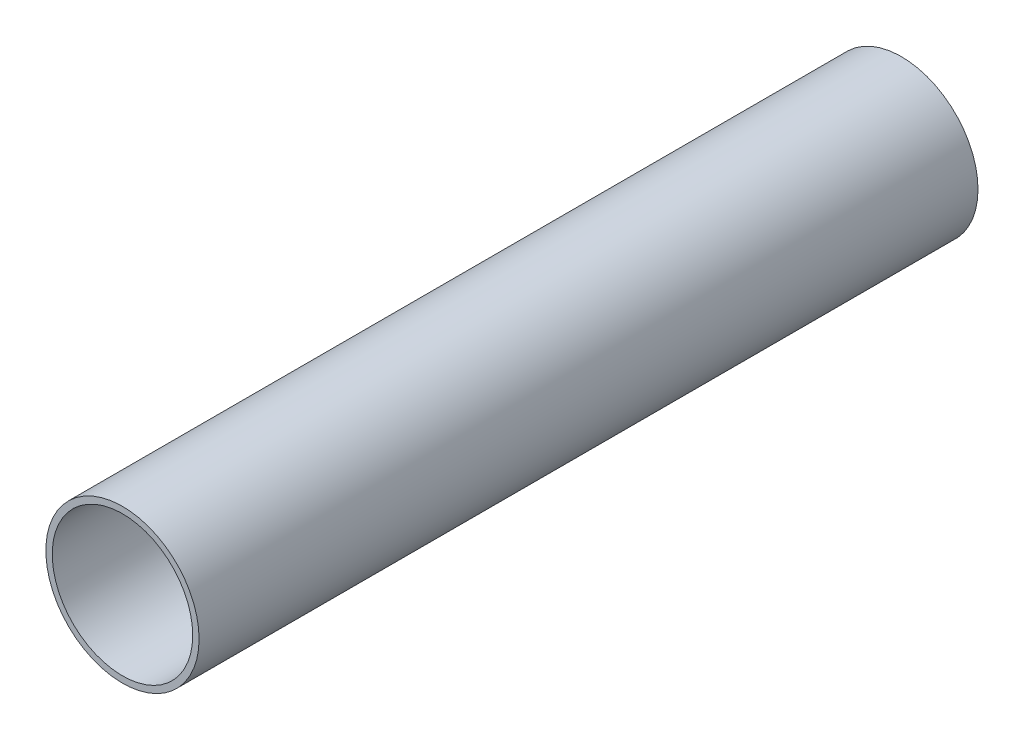
ISO-10303-21;
HEADER;
FILE_DESCRIPTION(('STEP AP214'),'2;1');
FILE_NAME('part.step','',(''),(''),'','','');
FILE_SCHEMA(('AUTOMOTIVE_DESIGN { 1 0 10303 214 1 1 1 1 }'));
ENDSEC;
DATA;
#1=APPLICATION_CONTEXT('core data for automotive mechanical design processes');
#2=APPLICATION_PROTOCOL_DEFINITION('international standard','automotive_design',2000,#1);
#3=PRODUCT_CONTEXT('',#1,'mechanical');
#4=PRODUCT('Part','Part','',(#3));
#5=PRODUCT_RELATED_PRODUCT_CATEGORY('part','',(#4));
#6=PRODUCT_DEFINITION_FORMATION('','',#4);
#7=PRODUCT_DEFINITION_CONTEXT('part definition',#1,'design');
#8=PRODUCT_DEFINITION('design','',#6,#7);
#9=PRODUCT_DEFINITION_SHAPE('','',#8);
#10=(LENGTH_UNIT() NAMED_UNIT(*) SI_UNIT(.MILLI.,.METRE.));
#11=(NAMED_UNIT(*) PLANE_ANGLE_UNIT() SI_UNIT($,.RADIAN.));
#12=(NAMED_UNIT(*) SI_UNIT($,.STERADIAN.) SOLID_ANGLE_UNIT());
#13=UNCERTAINTY_MEASURE_WITH_UNIT(LENGTH_MEASURE(1.E-05),#10,'distance_accuracy_value','');
#14=(GEOMETRIC_REPRESENTATION_CONTEXT(3) GLOBAL_UNCERTAINTY_ASSIGNED_CONTEXT((#13)) GLOBAL_UNIT_ASSIGNED_CONTEXT((#10,
#11,#12)) REPRESENTATION_CONTEXT('',''));
#15=CARTESIAN_POINT('',(0.,0.,0.));
#16=DIRECTION('',(0.,0.,1.));
#17=DIRECTION('',(1.,0.,0.));
#18=AXIS2_PLACEMENT_3D('',#15,#16,#17);
#19=CARTESIAN_POINT('',(0.,0.,762.));
#20=DIRECTION('',(0.,0.,-1.));
#21=DIRECTION('',(-1.,0.,0.));
#22=AXIS2_PLACEMENT_3D('',#19,#20,#21);
#23=CYLINDRICAL_SURFACE('',#22,69.85);
#24=CARTESIAN_POINT('',(0.,0.,762.));
#25=DIRECTION('',(0.,0.,1.));
#26=DIRECTION('',(1.,0.,0.));
#27=AXIS2_PLACEMENT_3D('',#24,#25,#26);
#28=CIRCLE('',#27,69.85);
#29=CARTESIAN_POINT('',(69.85,0.,762.));
#30=VERTEX_POINT('',#29);
#31=EDGE_CURVE('E43',#30,#30,#28,.T.);
#32=ORIENTED_EDGE('',*,*,#31,.T.);
#33=EDGE_LOOP('',(#32));
#34=FACE_BOUND('',#33,.T.);
#35=CARTESIAN_POINT('',(0.,0.,0.));
#36=DIRECTION('',(0.,0.,1.));
#37=DIRECTION('',(1.,0.,0.));
#38=AXIS2_PLACEMENT_3D('',#35,#36,#37);
#39=CIRCLE('',#38,69.85);
#40=CARTESIAN_POINT('',(69.85,0.,0.));
#41=VERTEX_POINT('',#40);
#42=EDGE_CURVE('E39',#41,#41,#39,.T.);
#43=ORIENTED_EDGE('',*,*,#42,.F.);
#44=EDGE_LOOP('',(#43));
#45=FACE_BOUND('',#44,.T.);
#46=ADVANCED_FACE('F36',(#34,#45),#23,.F.);
#47=CARTESIAN_POINT('',(0.,0.,762.));
#48=DIRECTION('',(0.,0.,-1.));
#49=DIRECTION('',(-1.,0.,0.));
#50=AXIS2_PLACEMENT_3D('',#47,#48,#49);
#51=CYLINDRICAL_SURFACE('',#50,76.2);
#52=CARTESIAN_POINT('',(0.,0.,762.));
#53=DIRECTION('',(0.,0.,1.));
#54=DIRECTION('',(1.,0.,0.));
#55=AXIS2_PLACEMENT_3D('',#52,#53,#54);
#56=CIRCLE('',#55,76.2);
#57=CARTESIAN_POINT('',(76.2,0.,762.));
#58=VERTEX_POINT('',#57);
#59=EDGE_CURVE('E10',#58,#58,#56,.T.);
#60=ORIENTED_EDGE('',*,*,#59,.F.);
#61=EDGE_LOOP('',(#60));
#62=FACE_BOUND('',#61,.T.);
#63=CARTESIAN_POINT('',(0.,0.,-12.7));
#64=DIRECTION('',(0.,0.,1.));
#65=DIRECTION('',(1.,0.,0.));
#66=AXIS2_PLACEMENT_3D('',#63,#64,#65);
#67=CIRCLE('',#66,76.2);
#68=CARTESIAN_POINT('',(76.2,0.,-12.7));
#69=VERTEX_POINT('',#68);
#70=EDGE_CURVE('E53',#69,#69,#67,.T.);
#71=ORIENTED_EDGE('',*,*,#70,.T.);
#72=EDGE_LOOP('',(#71));
#73=FACE_BOUND('',#72,.T.);
#74=ADVANCED_FACE('F77',(#62,#73),#51,.T.);
#75=CARTESIAN_POINT('',(0.,0.,762.));
#76=DIRECTION('',(0.,0.,1.));
#77=DIRECTION('',(1.,0.,0.));
#78=AXIS2_PLACEMENT_3D('',#75,#76,#77);
#79=PLANE('',#78);
#80=ORIENTED_EDGE('',*,*,#31,.F.);
#81=EDGE_LOOP('',(#80));
#82=FACE_BOUND('',#81,.T.);
#83=ORIENTED_EDGE('',*,*,#59,.T.);
#84=EDGE_LOOP('',(#83));
#85=FACE_BOUND('',#84,.T.);
#86=ADVANCED_FACE('F71',(#82,#85),#79,.T.);
#87=CARTESIAN_POINT('',(0.,0.,0.));
#88=DIRECTION('',(0.,0.,1.));
#89=DIRECTION('',(1.,0.,0.));
#90=AXIS2_PLACEMENT_3D('',#87,#88,#89);
#91=PLANE('',#90);
#92=CARTESIAN_POINT('',(0.,0.,0.));
#93=DIRECTION('',(0.,0.,1.));
#94=DIRECTION('',(1.,0.,0.));
#95=AXIS2_PLACEMENT_3D('',#92,#93,#94);
#96=CIRCLE('',#95,63.5);
#97=CARTESIAN_POINT('',(63.5,0.,0.));
#98=VERTEX_POINT('',#97);
#99=EDGE_CURVE('E49',#98,#98,#96,.T.);
#100=ORIENTED_EDGE('',*,*,#99,.F.);
#101=EDGE_LOOP('',(#100));
#102=FACE_BOUND('',#101,.T.);
#103=ORIENTED_EDGE('',*,*,#42,.T.);
#104=EDGE_LOOP('',(#103));
#105=FACE_BOUND('',#104,.T.);
#106=ADVANCED_FACE('F65',(#102,#105),#91,.T.);
#107=CARTESIAN_POINT('',(0.,0.,-12.7));
#108=DIRECTION('',(0.,0.,1.));
#109=DIRECTION('',(1.,0.,0.));
#110=AXIS2_PLACEMENT_3D('',#107,#108,#109);
#111=CYLINDRICAL_SURFACE('',#110,63.5);
#112=CARTESIAN_POINT('',(0.,0.,-12.7));
#113=DIRECTION('',(0.,0.,1.));
#114=DIRECTION('',(1.,0.,0.));
#115=AXIS2_PLACEMENT_3D('',#112,#113,#114);
#116=CIRCLE('',#115,63.5);
#117=CARTESIAN_POINT('',(63.5,0.,-12.7));
#118=VERTEX_POINT('',#117);
#119=EDGE_CURVE('E52',#118,#118,#116,.T.);
#120=ORIENTED_EDGE('',*,*,#119,.F.);
#121=EDGE_LOOP('',(#120));
#122=FACE_BOUND('',#121,.T.);
#123=ORIENTED_EDGE('',*,*,#99,.T.);
#124=EDGE_LOOP('',(#123));
#125=FACE_BOUND('',#124,.T.);
#126=ADVANCED_FACE('F62',(#122,#125),#111,.F.);
#127=CARTESIAN_POINT('',(0.,0.,-12.7));
#128=DIRECTION('',(0.,0.,1.));
#129=DIRECTION('',(1.,0.,0.));
#130=AXIS2_PLACEMENT_3D('',#127,#128,#129);
#131=PLANE('',#130);
#132=ORIENTED_EDGE('',*,*,#119,.T.);
#133=EDGE_LOOP('',(#132));
#134=FACE_BOUND('',#133,.T.);
#135=ORIENTED_EDGE('',*,*,#70,.F.);
#136=EDGE_LOOP('',(#135));
#137=FACE_BOUND('',#136,.T.);
#138=ADVANCED_FACE('F59',(#134,#137),#131,.F.);
#139=CLOSED_SHELL('',(#46,#74,#86,#106,#126,#138));
#140=MANIFOLD_SOLID_BREP('B2',#139);
#141=ADVANCED_BREP_SHAPE_REPRESENTATION('',(#18,#140),#14);
#142=SHAPE_DEFINITION_REPRESENTATION(#9,#141);
ENDSEC;
END-ISO-10303-21;
